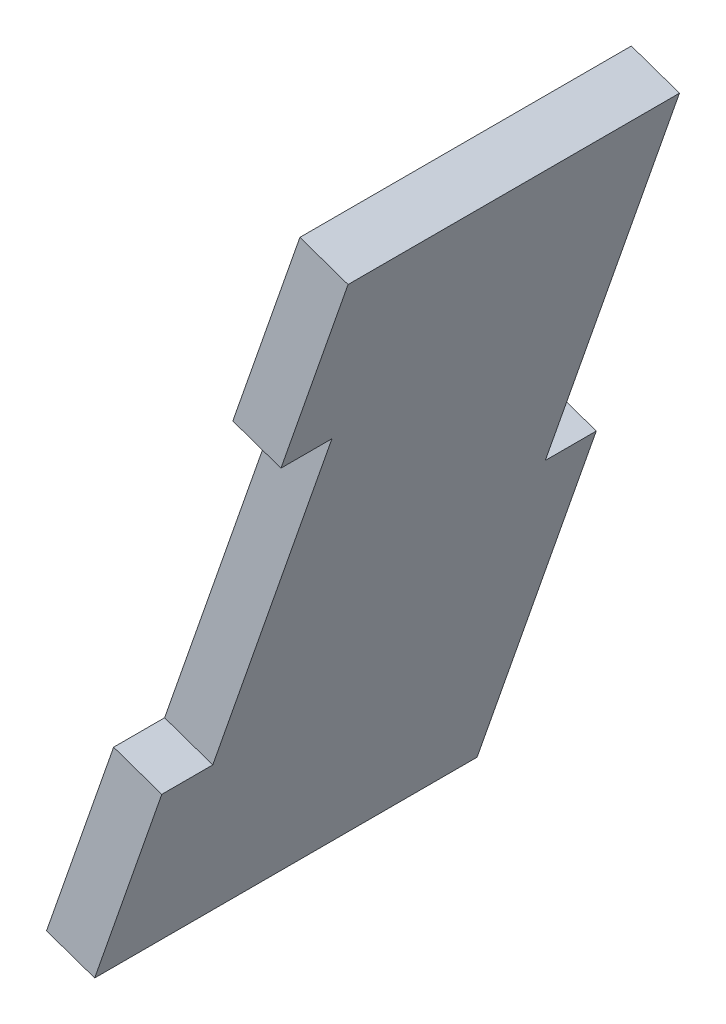
ISO-10303-21;
HEADER;
FILE_DESCRIPTION(('STEP AP214'),'2;1');
FILE_NAME('part.step','',(''),(''),'','','');
FILE_SCHEMA(('AUTOMOTIVE_DESIGN { 1 0 10303 214 1 1 1 1 }'));
ENDSEC;
DATA;
#1=APPLICATION_CONTEXT('core data for automotive mechanical design processes');
#2=APPLICATION_PROTOCOL_DEFINITION('international standard','automotive_design',2000,#1);
#3=PRODUCT_CONTEXT('',#1,'mechanical');
#4=PRODUCT('Part','Part','',(#3));
#5=PRODUCT_RELATED_PRODUCT_CATEGORY('part','',(#4));
#6=PRODUCT_DEFINITION_FORMATION('','',#4);
#7=PRODUCT_DEFINITION_CONTEXT('part definition',#1,'design');
#8=PRODUCT_DEFINITION('design','',#6,#7);
#9=PRODUCT_DEFINITION_SHAPE('','',#8);
#10=(LENGTH_UNIT() NAMED_UNIT(*) SI_UNIT(.MILLI.,.METRE.));
#11=(NAMED_UNIT(*) PLANE_ANGLE_UNIT() SI_UNIT($,.RADIAN.));
#12=(NAMED_UNIT(*) SI_UNIT($,.STERADIAN.) SOLID_ANGLE_UNIT());
#13=UNCERTAINTY_MEASURE_WITH_UNIT(LENGTH_MEASURE(1.E-05),#10,'distance_accuracy_value','');
#14=(GEOMETRIC_REPRESENTATION_CONTEXT(3) GLOBAL_UNCERTAINTY_ASSIGNED_CONTEXT((#13)) GLOBAL_UNIT_ASSIGNED_CONTEXT((#10,
#11,#12)) REPRESENTATION_CONTEXT('',''));
#15=CARTESIAN_POINT('',(0.,0.,0.));
#16=DIRECTION('',(0.,0.,1.));
#17=DIRECTION('',(1.,0.,0.));
#18=AXIS2_PLACEMENT_3D('',#15,#16,#17);
#19=CARTESIAN_POINT('',(0.,0.,0.));
#20=DIRECTION('',(0.,0.,1.));
#21=DIRECTION('',(1.,0.,0.));
#22=AXIS2_PLACEMENT_3D('',#19,#20,#21);
#23=PLANE('',#22);
#24=DIRECTION('',(0.94432372993579,-0.32901777015863,0.));
#25=VECTOR('',#24,1.);
#26=CARTESIAN_POINT('',(318.487323349547,303.395415609717,0.));
#27=LINE('',#26,#25);
#28=CARTESIAN_POINT('',(318.487323349547,303.395415609717,0.));
#29=VERTEX_POINT('',#28);
#30=CARTESIAN_POINT('',(321.485551192094,302.350784189464,0.));
#31=VERTEX_POINT('',#30);
#32=EDGE_CURVE('E174',#29,#31,#27,.T.);
#33=ORIENTED_EDGE('',*,*,#32,.T.);
#34=DIRECTION('',(0.32901777015863,0.94432372993579,0.));
#35=VECTOR('',#34,1.);
#36=CARTESIAN_POINT('',(309.885267674269,269.056463962982,0.));
#37=LINE('',#36,#35);
#38=CARTESIAN_POINT('',(325.664076873108,314.343695559648,0.));
#39=VERTEX_POINT('',#38);
#40=EDGE_CURVE('E150',#31,#39,#37,.T.);
#41=ORIENTED_EDGE('',*,*,#40,.T.);
#42=DIRECTION('',(-0.944323729935793,0.329017770158621,0.));
#43=VECTOR('',#42,1.);
#44=CARTESIAN_POINT('',(325.664076873108,314.343695559648,0.));
#45=LINE('',#44,#43);
#46=CARTESIAN_POINT('',(322.665849030562,315.388326979902,0.));
#47=VERTEX_POINT('',#46);
#48=EDGE_CURVE('E136',#39,#47,#45,.T.);
#49=ORIENTED_EDGE('',*,*,#48,.T.);
#50=DIRECTION('',(-0.32901777015863,-0.94432372993579,0.));
#51=VECTOR('',#50,1.);
#52=CARTESIAN_POINT('',(322.665849030562,315.388326979902,0.));
#53=LINE('',#52,#51);
#54=EDGE_CURVE('E135',#47,#29,#53,.T.);
#55=ORIENTED_EDGE('',*,*,#54,.T.);
#56=EDGE_LOOP('',(#33,#41,#49,#55));
#57=FACE_BOUND('',#56,.T.);
#58=ADVANCED_FACE('F33',(#57),#23,.T.);
#59=CARTESIAN_POINT('',(432.710213037799,335.493380268929,-23.8125000000004));
#60=DIRECTION('',(0.,0.,-1.));
#61=DIRECTION('',(-0.999997615388015,0.00218385399765417,0.));
#62=AXIS2_PLACEMENT_3D('',#59,#60,#61);
#63=PLANE('',#62);
#64=DIRECTION('',(0.94432372993579,-0.32901777015863,0.));
#65=VECTOR('',#64,1.);
#66=CARTESIAN_POINT('',(314.308797668533,291.402504239533,-23.8125000000003));
#67=LINE('',#66,#65);
#68=CARTESIAN_POINT('',(314.308797668533,291.402504239533,-23.8125000000003));
#69=VERTEX_POINT('',#68);
#70=CARTESIAN_POINT('',(317.307025511079,290.357872819279,-23.8125000000003));
#71=VERTEX_POINT('',#70);
#72=EDGE_CURVE('E151',#69,#71,#67,.T.);
#73=ORIENTED_EDGE('',*,*,#72,.T.);
#74=DIRECTION('',(0.32901777015863,0.94432372993579,0.));
#75=VECTOR('',#74,1.);
#76=CARTESIAN_POINT('',(309.885267674269,269.056463962982,-23.8125000000003));
#77=LINE('',#76,#75);
#78=CARTESIAN_POINT('',(309.885267674269,269.056463962982,-23.8125000000003));
#79=VERTEX_POINT('',#78);
#80=EDGE_CURVE('E139',#79,#71,#77,.T.);
#81=ORIENTED_EDGE('',*,*,#80,.F.);
#82=DIRECTION('',(-0.944323729935788,0.329017770158636,0.));
#83=VECTOR('',#82,1.);
#84=CARTESIAN_POINT('',(309.885267674269,269.056463962982,-23.8125000000003));
#85=LINE('',#84,#83);
#86=CARTESIAN_POINT('',(306.887039831723,270.101095383236,-23.8125000000003));
#87=VERTEX_POINT('',#86);
#88=EDGE_CURVE('E147',#79,#87,#85,.T.);
#89=ORIENTED_EDGE('',*,*,#88,.T.);
#90=DIRECTION('',(-0.32901777015863,-0.94432372993579,0.));
#91=VECTOR('',#90,1.);
#92=CARTESIAN_POINT('',(322.665849030562,315.388326979902,-23.8125000000003));
#93=LINE('',#92,#91);
#94=EDGE_CURVE('E152',#69,#87,#93,.T.);
#95=ORIENTED_EDGE('',*,*,#94,.F.);
#96=EDGE_LOOP('',(#73,#81,#89,#95));
#97=FACE_BOUND('',#96,.T.);
#98=ADVANCED_FACE('F35',(#97),#63,.T.);
#99=DIRECTION('',(0.94432372993579,-0.32901777015863,0.));
#100=VECTOR('',#99,1.);
#101=CARTESIAN_POINT('',(311.065565512738,282.09400675342,0.));
#102=LINE('',#101,#100);
#103=CARTESIAN_POINT('',(311.065565512738,282.09400675342,0.));
#104=VERTEX_POINT('',#103);
#105=CARTESIAN_POINT('',(314.063793355284,281.049375333167,0.));
#106=VERTEX_POINT('',#105);
#107=EDGE_CURVE('E114',#104,#106,#102,.T.);
#108=ORIENTED_EDGE('',*,*,#107,.F.);
#109=CARTESIAN_POINT('',(306.887039831723,270.101095383236,0.));
#110=VERTEX_POINT('',#109);
#111=EDGE_CURVE('E125',#104,#110,#53,.T.);
#112=ORIENTED_EDGE('',*,*,#111,.T.);
#113=DIRECTION('',(-0.944323729935788,0.329017770158636,0.));
#114=VECTOR('',#113,1.);
#115=CARTESIAN_POINT('',(309.885267674269,269.056463962982,0.));
#116=LINE('',#115,#114);
#117=CARTESIAN_POINT('',(309.885267674269,269.056463962982,0.));
#118=VERTEX_POINT('',#117);
#119=EDGE_CURVE('E11',#118,#110,#116,.T.);
#120=ORIENTED_EDGE('',*,*,#119,.F.);
#121=EDGE_CURVE('E128',#118,#106,#37,.T.);
#122=ORIENTED_EDGE('',*,*,#121,.T.);
#123=EDGE_LOOP('',(#108,#112,#120,#122));
#124=FACE_BOUND('',#123,.T.);
#125=ADVANCED_FACE('F123',(#124),#23,.T.);
#126=CARTESIAN_POINT('',(309.885267674269,269.056463962982,-73.8046858961197));
#127=DIRECTION('',(0.94432372993579,-0.32901777015863,0.));
#128=DIRECTION('',(0.32901777015863,0.94432372993579,0.));
#129=AXIS2_PLACEMENT_3D('',#126,#127,#128);
#130=PLANE('',#129);
#131=DIRECTION('',(0.,0.,1.));
#132=VECTOR('',#131,1.);
#133=CARTESIAN_POINT('',(321.485551192094,302.350784189464,0.));
#134=LINE('',#133,#132);
#135=CARTESIAN_POINT('',(321.485551192094,302.350784189464,-3.17500000000004));
#136=VERTEX_POINT('',#135);
#137=EDGE_CURVE('E119',#136,#31,#134,.T.);
#138=ORIENTED_EDGE('',*,*,#137,.F.);
#139=DIRECTION('',(0.329017770158629,0.94432372993579,0.));
#140=VECTOR('',#139,1.);
#141=CARTESIAN_POINT('',(321.485551192094,302.350784189464,-3.17500000000004));
#142=LINE('',#141,#140);
#143=CARTESIAN_POINT('',(314.063793355284,281.049375333167,-3.17500000000004));
#144=VERTEX_POINT('',#143);
#145=EDGE_CURVE('E194',#144,#136,#142,.T.);
#146=ORIENTED_EDGE('',*,*,#145,.F.);
#147=DIRECTION('',(0.,0.,-1.));
#148=VECTOR('',#147,1.);
#149=CARTESIAN_POINT('',(314.063793355284,281.049375333167,0.));
#150=LINE('',#149,#148);
#151=EDGE_CURVE('E197',#106,#144,#150,.T.);
#152=ORIENTED_EDGE('',*,*,#151,.F.);
#153=ORIENTED_EDGE('',*,*,#121,.F.);
#154=DIRECTION('',(0.,0.,1.));
#155=VECTOR('',#154,1.);
#156=CARTESIAN_POINT('',(309.885267674269,269.056463962982,-73.8046858961197));
#157=LINE('',#156,#155);
#158=EDGE_CURVE('E37',#79,#118,#157,.T.);
#159=ORIENTED_EDGE('',*,*,#158,.F.);
#160=ORIENTED_EDGE('',*,*,#80,.T.);
#161=DIRECTION('',(0.,0.,-1.));
#162=VECTOR('',#161,1.);
#163=CARTESIAN_POINT('',(317.307025511079,290.357872819279,-23.8125000000003));
#164=LINE('',#163,#162);
#165=CARTESIAN_POINT('',(317.307025511079,290.357872819279,-20.6375000000004));
#166=VERTEX_POINT('',#165);
#167=EDGE_CURVE('E182',#166,#71,#164,.T.);
#168=ORIENTED_EDGE('',*,*,#167,.F.);
#169=DIRECTION('',(-0.329017770158627,-0.944323729935791,0.));
#170=VECTOR('',#169,1.);
#171=CARTESIAN_POINT('',(325.664076873108,314.343695559648,-20.6375000000004));
#172=LINE('',#171,#170);
#173=CARTESIAN_POINT('',(325.664076873108,314.343695559648,-20.6375000000004));
#174=VERTEX_POINT('',#173);
#175=EDGE_CURVE('E166',#174,#166,#172,.T.);
#176=ORIENTED_EDGE('',*,*,#175,.F.);
#177=DIRECTION('',(0.,0.,1.));
#178=VECTOR('',#177,1.);
#179=CARTESIAN_POINT('',(325.664076873108,314.343695559648,-73.8046858961197));
#180=LINE('',#179,#178);
#181=EDGE_CURVE('E146',#174,#39,#180,.T.);
#182=ORIENTED_EDGE('',*,*,#181,.T.);
#183=ORIENTED_EDGE('',*,*,#40,.F.);
#184=EDGE_LOOP('',(#138,#146,#152,#153,#159,#160,#168,#176,#182,#183));
#185=FACE_BOUND('',#184,.T.);
#186=ADVANCED_FACE('F163',(#185),#130,.T.);
#187=CARTESIAN_POINT('',(325.664076873108,314.343695559648,-73.8046858961197));
#188=DIRECTION('',(0.329017770158621,0.944323729935793,0.));
#189=DIRECTION('',(-0.944323729935793,0.329017770158621,0.));
#190=AXIS2_PLACEMENT_3D('',#187,#188,#189);
#191=PLANE('',#190);
#192=DIRECTION('',(0.94432372993579,-0.32901777015863,0.));
#193=VECTOR('',#192,1.);
#194=CARTESIAN_POINT('',(322.665849030562,315.388326979902,-20.6375000000004));
#195=LINE('',#194,#193);
#196=CARTESIAN_POINT('',(322.665849030562,315.388326979902,-20.6375000000004));
#197=VERTEX_POINT('',#196);
#198=EDGE_CURVE('E176',#197,#174,#195,.T.);
#199=ORIENTED_EDGE('',*,*,#198,.F.);
#200=DIRECTION('',(0.,0.,1.));
#201=VECTOR('',#200,1.);
#202=CARTESIAN_POINT('',(322.665849030562,315.388326979902,-73.8046858961197));
#203=LINE('',#202,#201);
#204=EDGE_CURVE('E154',#197,#47,#203,.T.);
#205=ORIENTED_EDGE('',*,*,#204,.T.);
#206=ORIENTED_EDGE('',*,*,#48,.F.);
#207=ORIENTED_EDGE('',*,*,#181,.F.);
#208=EDGE_LOOP('',(#199,#205,#206,#207));
#209=FACE_BOUND('',#208,.T.);
#210=ADVANCED_FACE('F169',(#209),#191,.T.);
#211=CARTESIAN_POINT('',(322.665849030562,315.388326979902,-73.8046858961197));
#212=DIRECTION('',(-0.94432372993579,0.32901777015863,0.));
#213=DIRECTION('',(-0.32901777015863,-0.94432372993579,0.));
#214=AXIS2_PLACEMENT_3D('',#211,#212,#213);
#215=PLANE('',#214);
#216=DIRECTION('',(0.,0.,1.));
#217=VECTOR('',#216,1.);
#218=CARTESIAN_POINT('',(318.487323349547,303.395415609717,0.));
#219=LINE('',#218,#217);
#220=CARTESIAN_POINT('',(318.487323349547,303.395415609717,-3.17500000000004));
#221=VERTEX_POINT('',#220);
#222=EDGE_CURVE('E129',#221,#29,#219,.T.);
#223=ORIENTED_EDGE('',*,*,#222,.T.);
#224=ORIENTED_EDGE('',*,*,#54,.F.);
#225=ORIENTED_EDGE('',*,*,#204,.F.);
#226=DIRECTION('',(-0.329017770158627,-0.944323729935791,0.));
#227=VECTOR('',#226,1.);
#228=CARTESIAN_POINT('',(322.665849030562,315.388326979902,-20.6375000000004));
#229=LINE('',#228,#227);
#230=CARTESIAN_POINT('',(314.308797668533,291.402504239534,-20.6375000000004));
#231=VERTEX_POINT('',#230);
#232=EDGE_CURVE('E184',#197,#231,#229,.T.);
#233=ORIENTED_EDGE('',*,*,#232,.T.);
#234=DIRECTION('',(0.,0.,-1.));
#235=VECTOR('',#234,1.);
#236=CARTESIAN_POINT('',(314.308797668533,291.402504239533,-23.8125000000003));
#237=LINE('',#236,#235);
#238=EDGE_CURVE('E57',#231,#69,#237,.T.);
#239=ORIENTED_EDGE('',*,*,#238,.T.);
#240=ORIENTED_EDGE('',*,*,#94,.T.);
#241=DIRECTION('',(0.,0.,1.));
#242=VECTOR('',#241,1.);
#243=CARTESIAN_POINT('',(306.887039831723,270.101095383236,-73.8046858961197));
#244=LINE('',#243,#242);
#245=EDGE_CURVE('E134',#87,#110,#244,.T.);
#246=ORIENTED_EDGE('',*,*,#245,.T.);
#247=ORIENTED_EDGE('',*,*,#111,.F.);
#248=DIRECTION('',(0.,0.,-1.));
#249=VECTOR('',#248,1.);
#250=CARTESIAN_POINT('',(311.065565512738,282.09400675342,0.));
#251=LINE('',#250,#249);
#252=CARTESIAN_POINT('',(311.065565512738,282.09400675342,-3.17500000000004));
#253=VERTEX_POINT('',#252);
#254=EDGE_CURVE('E110',#104,#253,#251,.T.);
#255=ORIENTED_EDGE('',*,*,#254,.T.);
#256=DIRECTION('',(0.329017770158629,0.94432372993579,0.));
#257=VECTOR('',#256,1.);
#258=CARTESIAN_POINT('',(318.487323349547,303.395415609717,-3.17500000000004));
#259=LINE('',#258,#257);
#260=EDGE_CURVE('E49',#253,#221,#259,.T.);
#261=ORIENTED_EDGE('',*,*,#260,.T.);
#262=EDGE_LOOP('',(#223,#224,#225,#233,#239,#240,#246,#247,#255,#261));
#263=FACE_BOUND('',#262,.T.);
#264=ADVANCED_FACE('F132',(#263),#215,.T.);
#265=CARTESIAN_POINT('',(309.885267674269,269.056463962982,-73.8046858961197));
#266=DIRECTION('',(0.329017770158636,0.944323729935788,0.));
#267=DIRECTION('',(-0.944323729935788,0.329017770158636,0.));
#268=AXIS2_PLACEMENT_3D('',#265,#266,#267);
#269=PLANE('',#268);
#270=ORIENTED_EDGE('',*,*,#88,.F.);
#271=ORIENTED_EDGE('',*,*,#158,.T.);
#272=ORIENTED_EDGE('',*,*,#119,.T.);
#273=ORIENTED_EDGE('',*,*,#245,.F.);
#274=EDGE_LOOP('',(#270,#271,#272,#273));
#275=FACE_BOUND('',#274,.T.);
#276=ADVANCED_FACE('F232',(#275),#269,.F.);
#277=CARTESIAN_POINT('',(314.308797668533,291.402504239533,-23.8125000000003));
#278=DIRECTION('',(-0.32901777015863,-0.94432372993579,0.));
#279=DIRECTION('',(0.94432372993579,-0.32901777015863,0.));
#280=AXIS2_PLACEMENT_3D('',#277,#278,#279);
#281=PLANE('',#280);
#282=ORIENTED_EDGE('',*,*,#167,.T.);
#283=ORIENTED_EDGE('',*,*,#72,.F.);
#284=ORIENTED_EDGE('',*,*,#238,.F.);
#285=DIRECTION('',(0.94432372993579,-0.32901777015863,0.));
#286=VECTOR('',#285,1.);
#287=CARTESIAN_POINT('',(314.308797668533,291.402504239533,-20.6375000000004));
#288=LINE('',#287,#286);
#289=EDGE_CURVE('E178',#231,#166,#288,.T.);
#290=ORIENTED_EDGE('',*,*,#289,.T.);
#291=EDGE_LOOP('',(#282,#283,#284,#290));
#292=FACE_BOUND('',#291,.T.);
#293=ADVANCED_FACE('F234',(#292),#281,.F.);
#294=CARTESIAN_POINT('',(322.665849030562,315.388326979902,-20.6375000000004));
#295=DIRECTION('',(0.,0.,1.));
#296=DIRECTION('',(0.,-1.,0.));
#297=AXIS2_PLACEMENT_3D('',#294,#295,#296);
#298=PLANE('',#297);
#299=ORIENTED_EDGE('',*,*,#175,.T.);
#300=ORIENTED_EDGE('',*,*,#289,.F.);
#301=ORIENTED_EDGE('',*,*,#232,.F.);
#302=ORIENTED_EDGE('',*,*,#198,.T.);
#303=EDGE_LOOP('',(#299,#300,#301,#302));
#304=FACE_BOUND('',#303,.T.);
#305=ADVANCED_FACE('F212',(#304),#298,.F.);
#306=CARTESIAN_POINT('',(318.487323349547,303.395415609717,0.));
#307=DIRECTION('',(0.32901777015863,0.94432372993579,0.));
#308=DIRECTION('',(-0.94432372993579,0.32901777015863,0.));
#309=AXIS2_PLACEMENT_3D('',#306,#307,#308);
#310=PLANE('',#309);
#311=ORIENTED_EDGE('',*,*,#137,.T.);
#312=ORIENTED_EDGE('',*,*,#32,.F.);
#313=ORIENTED_EDGE('',*,*,#222,.F.);
#314=DIRECTION('',(0.94432372993579,-0.32901777015863,0.));
#315=VECTOR('',#314,1.);
#316=CARTESIAN_POINT('',(318.487323349547,303.395415609717,-3.17500000000004));
#317=LINE('',#316,#315);
#318=EDGE_CURVE('E190',#221,#136,#317,.T.);
#319=ORIENTED_EDGE('',*,*,#318,.T.);
#320=EDGE_LOOP('',(#311,#312,#313,#319));
#321=FACE_BOUND('',#320,.T.);
#322=ADVANCED_FACE('F202',(#321),#310,.F.);
#323=CARTESIAN_POINT('',(318.487323349547,303.395415609717,-3.17500000000004));
#324=DIRECTION('',(0.,0.,-1.));
#325=DIRECTION('',(0.,1.,0.));
#326=AXIS2_PLACEMENT_3D('',#323,#324,#325);
#327=PLANE('',#326);
#328=ORIENTED_EDGE('',*,*,#145,.T.);
#329=ORIENTED_EDGE('',*,*,#318,.F.);
#330=ORIENTED_EDGE('',*,*,#260,.F.);
#331=DIRECTION('',(0.94432372993579,-0.32901777015863,0.));
#332=VECTOR('',#331,1.);
#333=CARTESIAN_POINT('',(311.065565512738,282.09400675342,-3.17500000000004));
#334=LINE('',#333,#332);
#335=EDGE_CURVE('E116',#253,#144,#334,.T.);
#336=ORIENTED_EDGE('',*,*,#335,.T.);
#337=EDGE_LOOP('',(#328,#329,#330,#336));
#338=FACE_BOUND('',#337,.T.);
#339=ADVANCED_FACE('F204',(#338),#327,.F.);
#340=CARTESIAN_POINT('',(311.065565512738,282.09400675342,0.));
#341=DIRECTION('',(-0.32901777015863,-0.94432372993579,0.));
#342=DIRECTION('',(0.94432372993579,-0.32901777015863,0.));
#343=AXIS2_PLACEMENT_3D('',#340,#341,#342);
#344=PLANE('',#343);
#345=ORIENTED_EDGE('',*,*,#151,.T.);
#346=ORIENTED_EDGE('',*,*,#335,.F.);
#347=ORIENTED_EDGE('',*,*,#254,.F.);
#348=ORIENTED_EDGE('',*,*,#107,.T.);
#349=EDGE_LOOP('',(#345,#346,#347,#348));
#350=FACE_BOUND('',#349,.T.);
#351=ADVANCED_FACE('F113',(#350),#344,.F.);
#352=CLOSED_SHELL('',(#58,#98,#125,#186,#210,#264,#276,#293,#305,#322,#339,#351));
#353=MANIFOLD_SOLID_BREP('B2',#352);
#354=ADVANCED_BREP_SHAPE_REPRESENTATION('',(#18,#353),#14);
#355=SHAPE_DEFINITION_REPRESENTATION(#9,#354);
ENDSEC;
END-ISO-10303-21;
